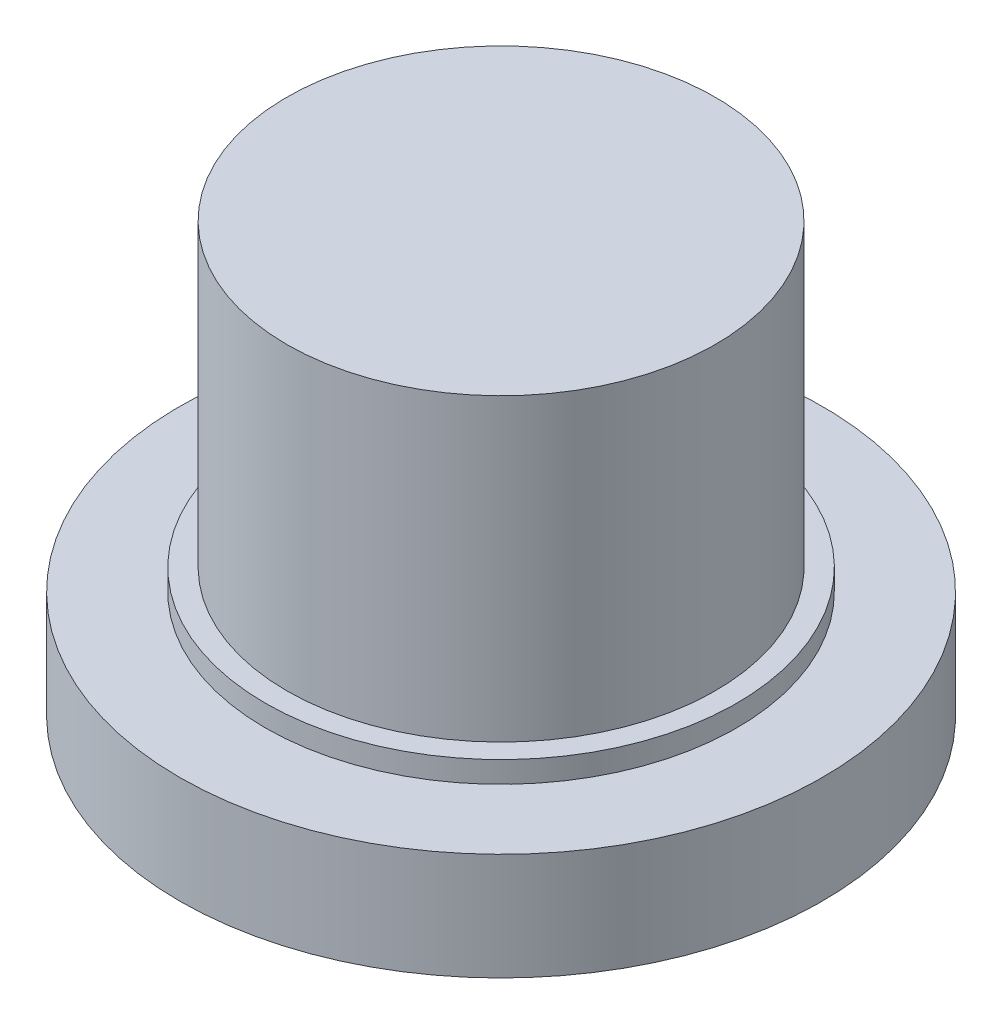
ISO-10303-21;
HEADER;
FILE_DESCRIPTION(('STEP AP214'),'2;1');
FILE_NAME('part.step','',(''),(''),'','','');
FILE_SCHEMA(('AUTOMOTIVE_DESIGN { 1 0 10303 214 1 1 1 1 }'));
ENDSEC;
DATA;
#1=APPLICATION_CONTEXT('core data for automotive mechanical design processes');
#2=APPLICATION_PROTOCOL_DEFINITION('international standard','automotive_design',2000,#1);
#3=PRODUCT_CONTEXT('',#1,'mechanical');
#4=PRODUCT('Part','Part','',(#3));
#5=PRODUCT_RELATED_PRODUCT_CATEGORY('part','',(#4));
#6=PRODUCT_DEFINITION_FORMATION('','',#4);
#7=PRODUCT_DEFINITION_CONTEXT('part definition',#1,'design');
#8=PRODUCT_DEFINITION('design','',#6,#7);
#9=PRODUCT_DEFINITION_SHAPE('','',#8);
#10=(LENGTH_UNIT() NAMED_UNIT(*) SI_UNIT(.MILLI.,.METRE.));
#11=(NAMED_UNIT(*) PLANE_ANGLE_UNIT() SI_UNIT($,.RADIAN.));
#12=(NAMED_UNIT(*) SI_UNIT($,.STERADIAN.) SOLID_ANGLE_UNIT());
#13=UNCERTAINTY_MEASURE_WITH_UNIT(LENGTH_MEASURE(1.E-05),#10,'distance_accuracy_value','');
#14=(GEOMETRIC_REPRESENTATION_CONTEXT(3) GLOBAL_UNCERTAINTY_ASSIGNED_CONTEXT((#13)) GLOBAL_UNIT_ASSIGNED_CONTEXT((#10,
#11,#12)) REPRESENTATION_CONTEXT('',''));
#15=CARTESIAN_POINT('',(0.,0.,0.));
#16=DIRECTION('',(0.,0.,1.));
#17=DIRECTION('',(1.,0.,0.));
#18=AXIS2_PLACEMENT_3D('',#15,#16,#17);
#19=CARTESIAN_POINT('',(0.,19.,0.));
#20=DIRECTION('',(0.,-1.,0.));
#21=DIRECTION('',(0.,0.,-1.));
#22=AXIS2_PLACEMENT_3D('',#19,#20,#21);
#23=CYLINDRICAL_SURFACE('',#22,7.5);
#24=CARTESIAN_POINT('',(0.,0.,0.));
#25=DIRECTION('',(0.,-1.,0.));
#26=DIRECTION('',(0.,0.,-1.));
#27=AXIS2_PLACEMENT_3D('',#24,#25,#26);
#28=CIRCLE('',#27,7.5);
#29=CARTESIAN_POINT('',(0.,0.,-7.5));
#30=VERTEX_POINT('',#29);
#31=EDGE_CURVE('E54',#30,#30,#28,.T.);
#32=ORIENTED_EDGE('',*,*,#31,.T.);
#33=EDGE_LOOP('',(#32));
#34=FACE_BOUND('',#33,.T.);
#35=CARTESIAN_POINT('',(0.,5.,0.));
#36=DIRECTION('',(0.,1.,0.));
#37=DIRECTION('',(0.,0.,1.));
#38=AXIS2_PLACEMENT_3D('',#35,#36,#37);
#39=CIRCLE('',#38,7.5);
#40=CARTESIAN_POINT('',(0.,5.,7.5));
#41=VERTEX_POINT('',#40);
#42=EDGE_CURVE('E10',#41,#41,#39,.F.);
#43=ORIENTED_EDGE('',*,*,#42,.F.);
#44=EDGE_LOOP('',(#43));
#45=FACE_BOUND('',#44,.T.);
#46=ADVANCED_FACE('F32',(#34,#45),#23,.F.);
#47=CARTESIAN_POINT('',(0.,5.,0.));
#48=DIRECTION('',(0.,-1.,0.));
#49=DIRECTION('',(0.,0.,-1.));
#50=AXIS2_PLACEMENT_3D('',#47,#48,#49);
#51=CYLINDRICAL_SURFACE('',#50,15.);
#52=CARTESIAN_POINT('',(0.,5.,0.));
#53=DIRECTION('',(0.,1.,0.));
#54=DIRECTION('',(0.,0.,1.));
#55=AXIS2_PLACEMENT_3D('',#52,#53,#54);
#56=CIRCLE('',#55,15.);
#57=CARTESIAN_POINT('',(0.,5.,15.));
#58=VERTEX_POINT('',#57);
#59=EDGE_CURVE('E41',#58,#58,#56,.T.);
#60=ORIENTED_EDGE('',*,*,#59,.F.);
#61=EDGE_LOOP('',(#60));
#62=FACE_BOUND('',#61,.T.);
#63=CARTESIAN_POINT('',(0.,0.,0.));
#64=DIRECTION('',(0.,1.,0.));
#65=DIRECTION('',(0.,0.,1.));
#66=AXIS2_PLACEMENT_3D('',#63,#64,#65);
#67=CIRCLE('',#66,15.);
#68=CARTESIAN_POINT('',(0.,0.,15.));
#69=VERTEX_POINT('',#68);
#70=EDGE_CURVE('E45',#69,#69,#67,.T.);
#71=ORIENTED_EDGE('',*,*,#70,.T.);
#72=EDGE_LOOP('',(#71));
#73=FACE_BOUND('',#72,.T.);
#74=ADVANCED_FACE('F34',(#62,#73),#51,.T.);
#75=CARTESIAN_POINT('',(0.,5.,0.));
#76=DIRECTION('',(0.,1.,0.));
#77=DIRECTION('',(0.,0.,1.));
#78=AXIS2_PLACEMENT_3D('',#75,#76,#77);
#79=PLANE('',#78);
#80=CARTESIAN_POINT('',(0.,5.,0.));
#81=DIRECTION('',(0.,1.,0.));
#82=DIRECTION('',(0.,0.,1.));
#83=AXIS2_PLACEMENT_3D('',#80,#81,#82);
#84=CIRCLE('',#83,11.);
#85=CARTESIAN_POINT('',(0.,5.,11.));
#86=VERTEX_POINT('',#85);
#87=EDGE_CURVE('E62',#86,#86,#84,.T.);
#88=ORIENTED_EDGE('',*,*,#87,.F.);
#89=EDGE_LOOP('',(#88));
#90=FACE_BOUND('',#89,.T.);
#91=ORIENTED_EDGE('',*,*,#59,.T.);
#92=EDGE_LOOP('',(#91));
#93=FACE_BOUND('',#92,.T.);
#94=ADVANCED_FACE('F107',(#90,#93),#79,.T.);
#95=CARTESIAN_POINT('',(0.,0.,0.));
#96=DIRECTION('',(0.,1.,0.));
#97=DIRECTION('',(0.,0.,1.));
#98=AXIS2_PLACEMENT_3D('',#95,#96,#97);
#99=PLANE('',#98);
#100=ORIENTED_EDGE('',*,*,#31,.F.);
#101=EDGE_LOOP('',(#100));
#102=FACE_BOUND('',#101,.T.);
#103=ORIENTED_EDGE('',*,*,#70,.F.);
#104=EDGE_LOOP('',(#103));
#105=FACE_BOUND('',#104,.T.);
#106=ADVANCED_FACE('F109',(#102,#105),#99,.F.);
#107=CARTESIAN_POINT('',(0.,5.,0.));
#108=DIRECTION('',(0.,1.,0.));
#109=DIRECTION('',(0.,0.,1.));
#110=AXIS2_PLACEMENT_3D('',#107,#108,#109);
#111=PLANE('',#110);
#112=ORIENTED_EDGE('',*,*,#42,.T.);
#113=EDGE_LOOP('',(#112));
#114=FACE_BOUND('',#113,.T.);
#115=ADVANCED_FACE('F89',(#114),#111,.F.);
#116=CARTESIAN_POINT('',(0.,6.,0.));
#117=DIRECTION('',(0.,1.,0.));
#118=DIRECTION('',(0.,0.,1.));
#119=AXIS2_PLACEMENT_3D('',#116,#117,#118);
#120=PLANE('',#119);
#121=CARTESIAN_POINT('',(0.,6.,0.));
#122=DIRECTION('',(0.,1.,0.));
#123=DIRECTION('',(0.,0.,1.));
#124=AXIS2_PLACEMENT_3D('',#121,#122,#123);
#125=CIRCLE('',#124,11.);
#126=CARTESIAN_POINT('',(0.,6.,11.));
#127=VERTEX_POINT('',#126);
#128=EDGE_CURVE('E65',#127,#127,#125,.T.);
#129=ORIENTED_EDGE('',*,*,#128,.T.);
#130=EDGE_LOOP('',(#129));
#131=FACE_BOUND('',#130,.T.);
#132=CARTESIAN_POINT('',(0.,6.,0.));
#133=DIRECTION('',(0.,1.,0.));
#134=DIRECTION('',(0.,0.,1.));
#135=AXIS2_PLACEMENT_3D('',#132,#133,#134);
#136=CIRCLE('',#135,10.);
#137=CARTESIAN_POINT('',(0.,6.,10.));
#138=VERTEX_POINT('',#137);
#139=EDGE_CURVE('E57',#138,#138,#136,.T.);
#140=ORIENTED_EDGE('',*,*,#139,.F.);
#141=EDGE_LOOP('',(#140));
#142=FACE_BOUND('',#141,.T.);
#143=ADVANCED_FACE('F78',(#131,#142),#120,.T.);
#144=CARTESIAN_POINT('',(0.,6.,0.));
#145=DIRECTION('',(0.,-1.,0.));
#146=DIRECTION('',(0.,0.,-1.));
#147=AXIS2_PLACEMENT_3D('',#144,#145,#146);
#148=CYLINDRICAL_SURFACE('',#147,11.);
#149=ORIENTED_EDGE('',*,*,#128,.F.);
#150=EDGE_LOOP('',(#149));
#151=FACE_BOUND('',#150,.T.);
#152=ORIENTED_EDGE('',*,*,#87,.T.);
#153=EDGE_LOOP('',(#152));
#154=FACE_BOUND('',#153,.T.);
#155=ADVANCED_FACE('F88',(#151,#154),#148,.T.);
#156=CARTESIAN_POINT('',(0.,20.,0.));
#157=DIRECTION('',(0.,1.,0.));
#158=DIRECTION('',(0.,0.,1.));
#159=AXIS2_PLACEMENT_3D('',#156,#157,#158);
#160=PLANE('',#159);
#161=CARTESIAN_POINT('',(0.,20.,0.));
#162=DIRECTION('',(0.,1.,0.));
#163=DIRECTION('',(0.,0.,1.));
#164=AXIS2_PLACEMENT_3D('',#161,#162,#163);
#165=CIRCLE('',#164,10.);
#166=CARTESIAN_POINT('',(0.,20.,10.));
#167=VERTEX_POINT('',#166);
#168=EDGE_CURVE('E49',#167,#167,#165,.T.);
#169=ORIENTED_EDGE('',*,*,#168,.T.);
#170=EDGE_LOOP('',(#169));
#171=FACE_BOUND('',#170,.T.);
#172=ADVANCED_FACE('F99',(#171),#160,.T.);
#173=CARTESIAN_POINT('',(0.,20.,0.));
#174=DIRECTION('',(0.,-1.,0.));
#175=DIRECTION('',(0.,0.,-1.));
#176=AXIS2_PLACEMENT_3D('',#173,#174,#175);
#177=CYLINDRICAL_SURFACE('',#176,10.);
#178=ORIENTED_EDGE('',*,*,#139,.T.);
#179=EDGE_LOOP('',(#178));
#180=FACE_BOUND('',#179,.T.);
#181=ORIENTED_EDGE('',*,*,#168,.F.);
#182=EDGE_LOOP('',(#181));
#183=FACE_BOUND('',#182,.T.);
#184=ADVANCED_FACE('F102',(#180,#183),#177,.T.);
#185=CLOSED_SHELL('',(#46,#74,#94,#106,#115,#143,#155,#172,#184));
#186=CARTESIAN_POINT('',(0.,19.,0.));
#187=DIRECTION('',(0.,-1.,0.));
#188=DIRECTION('',(0.,0.,-1.));
#189=AXIS2_PLACEMENT_3D('',#186,#187,#188);
#190=PLANE('',#189);
#191=CARTESIAN_POINT('',(0.,19.,0.));
#192=DIRECTION('',(0.,-1.,0.));
#193=DIRECTION('',(0.,0.,-1.));
#194=AXIS2_PLACEMENT_3D('',#191,#192,#193);
#195=CIRCLE('',#194,7.5);
#196=CARTESIAN_POINT('',(0.,19.,-7.5));
#197=VERTEX_POINT('',#196);
#198=EDGE_CURVE('E53',#197,#197,#195,.T.);
#199=ORIENTED_EDGE('',*,*,#198,.T.);
#200=EDGE_LOOP('',(#199));
#201=FACE_BOUND('',#200,.T.);
#202=ADVANCED_FACE('F84',(#201),#190,.T.);
#203=CARTESIAN_POINT('',(0.,6.,0.));
#204=DIRECTION('',(0.,1.,0.));
#205=DIRECTION('',(0.,0.,1.));
#206=AXIS2_PLACEMENT_3D('',#203,#204,#205);
#207=CIRCLE('',#206,7.5);
#208=CARTESIAN_POINT('',(0.,6.,7.5));
#209=VERTEX_POINT('',#208);
#210=EDGE_CURVE('E36',#209,#209,#207,.F.);
#211=ORIENTED_EDGE('',*,*,#210,.T.);
#212=EDGE_LOOP('',(#211));
#213=FACE_BOUND('',#212,.T.);
#214=ORIENTED_EDGE('',*,*,#198,.F.);
#215=EDGE_LOOP('',(#214));
#216=FACE_BOUND('',#215,.T.);
#217=ADVANCED_FACE('F72',(#213,#216),#23,.F.);
#218=ORIENTED_EDGE('',*,*,#210,.F.);
#219=EDGE_LOOP('',(#218));
#220=FACE_BOUND('',#219,.T.);
#221=ADVANCED_FACE('F75',(#220),#120,.T.);
#222=CLOSED_SHELL('',(#202,#217,#221));
#223=ORIENTED_CLOSED_SHELL('',*,#222,.T.);
#224=BREP_WITH_VOIDS('B2',#185,(#223));
#225=ADVANCED_BREP_SHAPE_REPRESENTATION('',(#18,#224),#14);
#226=SHAPE_DEFINITION_REPRESENTATION(#9,#225);
ENDSEC;
END-ISO-10303-21;
